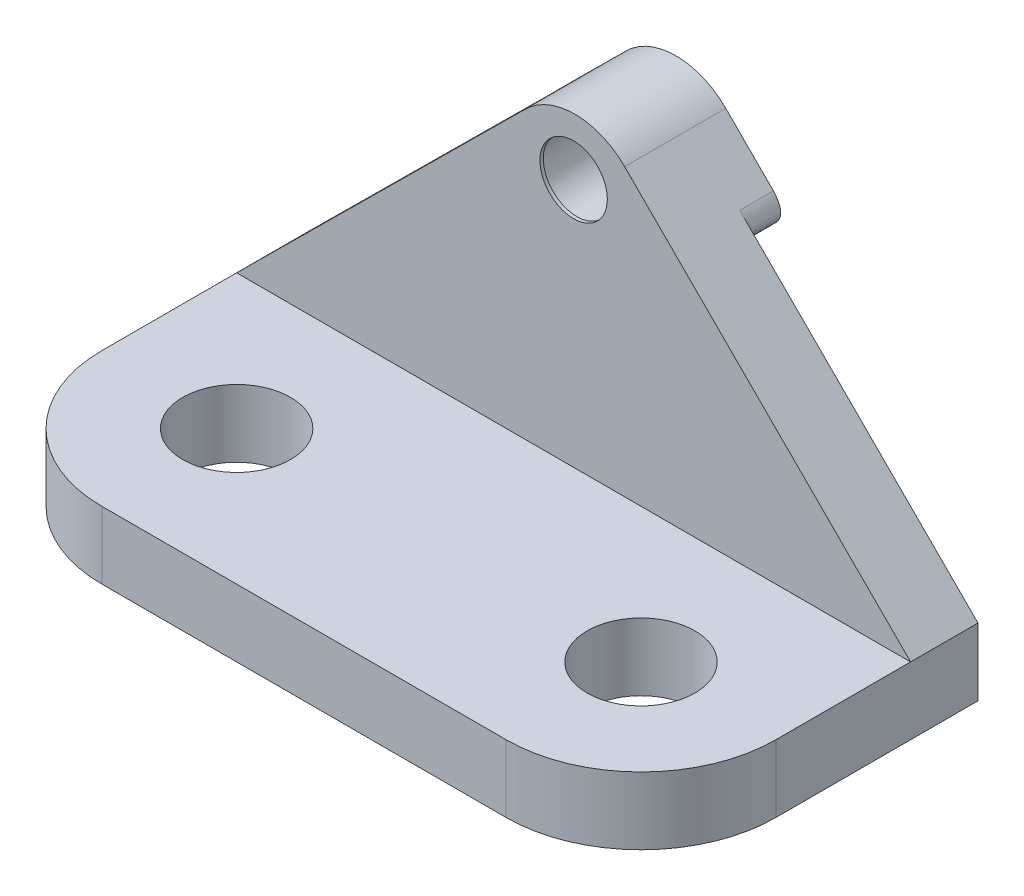
ISO-10303-21;
HEADER;
FILE_DESCRIPTION(('STEP AP214'),'2;1');
FILE_NAME('part.step','',(''),(''),'','','');
FILE_SCHEMA(('AUTOMOTIVE_DESIGN { 1 0 10303 214 1 1 1 1 }'));
ENDSEC;
DATA;
#1=APPLICATION_CONTEXT('core data for automotive mechanical design processes');
#2=APPLICATION_PROTOCOL_DEFINITION('international standard','automotive_design',2000,#1);
#3=PRODUCT_CONTEXT('',#1,'mechanical');
#4=PRODUCT('Part','Part','',(#3));
#5=PRODUCT_RELATED_PRODUCT_CATEGORY('part','',(#4));
#6=PRODUCT_DEFINITION_FORMATION('','',#4);
#7=PRODUCT_DEFINITION_CONTEXT('part definition',#1,'design');
#8=PRODUCT_DEFINITION('design','',#6,#7);
#9=PRODUCT_DEFINITION_SHAPE('','',#8);
#10=(LENGTH_UNIT() NAMED_UNIT(*) SI_UNIT(.MILLI.,.METRE.));
#11=(NAMED_UNIT(*) PLANE_ANGLE_UNIT() SI_UNIT($,.RADIAN.));
#12=(NAMED_UNIT(*) SI_UNIT($,.STERADIAN.) SOLID_ANGLE_UNIT());
#13=UNCERTAINTY_MEASURE_WITH_UNIT(LENGTH_MEASURE(1.E-05),#10,'distance_accuracy_value','');
#14=(GEOMETRIC_REPRESENTATION_CONTEXT(3) GLOBAL_UNCERTAINTY_ASSIGNED_CONTEXT((#13)) GLOBAL_UNIT_ASSIGNED_CONTEXT((#10,
#11,#12)) REPRESENTATION_CONTEXT('',''));
#15=CARTESIAN_POINT('',(0.,0.,0.));
#16=DIRECTION('',(0.,0.,1.));
#17=DIRECTION('',(1.,0.,0.));
#18=AXIS2_PLACEMENT_3D('',#15,#16,#17);
#19=CARTESIAN_POINT('',(0.,23.4788415531794,12.5));
#20=DIRECTION('',(0.,0.,-1.));
#21=DIRECTION('',(-1.,0.,0.));
#22=AXIS2_PLACEMENT_3D('',#19,#20,#21);
#23=CYLINDRICAL_SURFACE('',#22,2.5);
#24=CARTESIAN_POINT('',(0.,23.4788415531794,-7.5));
#25=DIRECTION('',(0.,0.,1.));
#26=DIRECTION('',(1.,0.,0.));
#27=AXIS2_PLACEMENT_3D('',#24,#25,#26);
#28=CIRCLE('',#27,2.5);
#29=CARTESIAN_POINT('',(2.5,23.4788415531794,-7.5));
#30=VERTEX_POINT('',#29);
#31=EDGE_CURVE('E164',#30,#30,#28,.T.);
#32=ORIENTED_EDGE('',*,*,#31,.T.);
#33=EDGE_LOOP('',(#32));
#34=FACE_BOUND('',#33,.T.);
#35=CARTESIAN_POINT('',(0.,23.4788415531794,-7.75));
#36=DIRECTION('',(0.,0.,-1.));
#37=DIRECTION('',(-1.,0.,0.));
#38=AXIS2_PLACEMENT_3D('',#35,#36,#37);
#39=CIRCLE('',#38,2.5);
#40=CARTESIAN_POINT('',(-2.5,23.4788415531794,-7.75));
#41=VERTEX_POINT('',#40);
#42=EDGE_CURVE('E38',#41,#41,#39,.F.);
#43=ORIENTED_EDGE('',*,*,#42,.F.);
#44=EDGE_LOOP('',(#43));
#45=FACE_BOUND('',#44,.T.);
#46=ADVANCED_FACE('F34',(#34,#45),#23,.F.);
#47=CARTESIAN_POINT('',(-25.,5.,-12.5));
#48=DIRECTION('',(0.,0.,1.));
#49=DIRECTION('',(1.,0.,0.));
#50=AXIS2_PLACEMENT_3D('',#47,#48,#49);
#51=PLANE('',#50);
#52=CARTESIAN_POINT('',(-6.90013036784785,20.2399334834772,-12.5));
#53=CARTESIAN_POINT('',(-8.70232576335587,21.2388118548097,-12.5));
#54=CARTESIAN_POINT('',(-7.24255586015702,22.5975332822631,-12.5));
#55=B_SPLINE_CURVE_WITH_KNOTS('',2,(#52,#53,#54),.UNSPECIFIED.,.F.,.F.,(3,3),(0.,1.),.UNSPECIFIED.);
#56=CARTESIAN_POINT('',(-6.90013036784785,20.2399334834771,-12.5));
#57=VERTEX_POINT('',#56);
#58=CARTESIAN_POINT('',(-7.40900852121652,22.43257957497,-12.5));
#59=VERTEX_POINT('',#58);
#60=EDGE_CURVE('E51',#57,#59,#55,.T.);
#61=ORIENTED_EDGE('',*,*,#60,.F.);
#62=CARTESIAN_POINT('',(-0.0436635000014337,32.9429249588641,-12.5));
#63=DIRECTION('',(0.,0.,-1.));
#64=DIRECTION('',(-1.,0.,0.));
#65=AXIS2_PLACEMENT_3D('',#62,#63,#64);
#66=CIRCLE('',#65,14.4352738226065);
#67=CARTESIAN_POINT('',(6.85532950865803,20.2629791466732,-12.5));
#68=VERTEX_POINT('',#67);
#69=EDGE_CURVE('E161',#68,#57,#66,.T.);
#70=ORIENTED_EDGE('',*,*,#69,.F.);
#71=CARTESIAN_POINT('',(7.32233047033633,22.6776695296637,-12.5));
#72=CARTESIAN_POINT('',(8.17845266769206,21.7030736056082,-12.5));
#73=CARTESIAN_POINT('',(8.02278568046596,20.898176811278,-12.5));
#74=CARTESIAN_POINT('',(6.85532950865803,20.2629791466732,-12.5));
#75=B_SPLINE_CURVE_WITH_KNOTS('',3,(#71,#72,#73,#74),.UNSPECIFIED.,.F.,.F.,(4,4),(0.,1.),.UNSPECIFIED.);
#76=CARTESIAN_POINT('',(7.32233047033635,22.6776695296637,-12.5));
#77=VERTEX_POINT('',#76);
#78=EDGE_CURVE('E57',#77,#68,#75,.T.);
#79=ORIENTED_EDGE('',*,*,#78,.F.);
#80=DIRECTION('',(0.707106781186547,-0.707106781186547,0.));
#81=VECTOR('',#80,1.);
#82=CARTESIAN_POINT('',(25.,5.,-12.5));
#83=LINE('',#82,#81);
#84=CARTESIAN_POINT('',(25.,5.,-12.5));
#85=VERTEX_POINT('',#84);
#86=EDGE_CURVE('E213',#77,#85,#83,.T.);
#87=ORIENTED_EDGE('',*,*,#86,.T.);
#88=DIRECTION('',(0.,-1.,0.));
#89=VECTOR('',#88,1.);
#90=CARTESIAN_POINT('',(25.,5.,-12.5));
#91=LINE('',#90,#89);
#92=CARTESIAN_POINT('',(25.,0.,-12.5));
#93=VERTEX_POINT('',#92);
#94=EDGE_CURVE('E324',#85,#93,#91,.T.);
#95=ORIENTED_EDGE('',*,*,#94,.T.);
#96=DIRECTION('',(-1.,0.,0.));
#97=VECTOR('',#96,1.);
#98=CARTESIAN_POINT('',(-25.,0.,-12.5));
#99=LINE('',#98,#97);
#100=CARTESIAN_POINT('',(-25.,0.,-12.5));
#101=VERTEX_POINT('',#100);
#102=EDGE_CURVE('E316',#93,#101,#99,.T.);
#103=ORIENTED_EDGE('',*,*,#102,.T.);
#104=DIRECTION('',(0.,-1.,0.));
#105=VECTOR('',#104,1.);
#106=CARTESIAN_POINT('',(-25.,5.,-12.5));
#107=LINE('',#106,#105);
#108=CARTESIAN_POINT('',(-25.,5.,-12.5));
#109=VERTEX_POINT('',#108);
#110=EDGE_CURVE('E314',#109,#101,#107,.T.);
#111=ORIENTED_EDGE('',*,*,#110,.F.);
#112=DIRECTION('',(0.710297765593719,0.703901331290523,0.));
#113=VECTOR('',#112,1.);
#114=CARTESIAN_POINT('',(-25.,5.,-12.5));
#115=LINE('',#114,#113);
#116=EDGE_CURVE('E205',#109,#59,#115,.T.);
#117=ORIENTED_EDGE('',*,*,#116,.T.);
#118=EDGE_LOOP('',(#61,#70,#79,#87,#95,#103,#111,#117));
#119=FACE_BOUND('',#118,.T.);
#120=ADVANCED_FACE('F372',(#119),#51,.F.);
#121=CARTESIAN_POINT('',(0.,5.,0.));
#122=DIRECTION('',(0.,-1.,0.));
#123=DIRECTION('',(0.,0.,-1.));
#124=AXIS2_PLACEMENT_3D('',#121,#122,#123);
#125=PLANE('',#124);
#126=CARTESIAN_POINT('',(-15.,5.,2.5));
#127=DIRECTION('',(0.,1.,0.));
#128=DIRECTION('',(0.,0.,1.));
#129=AXIS2_PLACEMENT_3D('',#126,#127,#128);
#130=CIRCLE('',#129,4.);
#131=CARTESIAN_POINT('',(-15.,5.,6.5));
#132=VERTEX_POINT('',#131);
#133=EDGE_CURVE('E298',#132,#132,#130,.T.);
#134=ORIENTED_EDGE('',*,*,#133,.F.);
#135=EDGE_LOOP('',(#134));
#136=FACE_BOUND('',#135,.T.);
#137=DIRECTION('',(0.,0.,-1.));
#138=VECTOR('',#137,1.);
#139=CARTESIAN_POINT('',(25.,5.,12.5));
#140=LINE('',#139,#138);
#141=CARTESIAN_POINT('',(25.,5.,2.5));
#142=VERTEX_POINT('',#141);
#143=CARTESIAN_POINT('',(25.,5.,-7.5));
#144=VERTEX_POINT('',#143);
#145=EDGE_CURVE('E304',#142,#144,#140,.T.);
#146=ORIENTED_EDGE('',*,*,#145,.T.);
#147=DIRECTION('',(-1.,0.,0.));
#148=VECTOR('',#147,1.);
#149=CARTESIAN_POINT('',(0.,5.,-7.5));
#150=LINE('',#149,#148);
#151=CARTESIAN_POINT('',(-25.,5.,-7.5));
#152=VERTEX_POINT('',#151);
#153=EDGE_CURVE('E288',#144,#152,#150,.T.);
#154=ORIENTED_EDGE('',*,*,#153,.T.);
#155=DIRECTION('',(0.,0.,1.));
#156=VECTOR('',#155,1.);
#157=CARTESIAN_POINT('',(-25.,5.,12.5));
#158=LINE('',#157,#156);
#159=CARTESIAN_POINT('',(-25.,5.,2.5));
#160=VERTEX_POINT('',#159);
#161=EDGE_CURVE('E307',#152,#160,#158,.T.);
#162=ORIENTED_EDGE('',*,*,#161,.T.);
#163=CARTESIAN_POINT('',(-15.,5.,2.5));
#164=DIRECTION('',(0.,-1.,0.));
#165=DIRECTION('',(0.,0.,-1.));
#166=AXIS2_PLACEMENT_3D('',#163,#164,#165);
#167=CIRCLE('',#166,10.);
#168=CARTESIAN_POINT('',(-15.,5.,12.5));
#169=VERTEX_POINT('',#168);
#170=EDGE_CURVE('E340',#160,#169,#167,.F.);
#171=ORIENTED_EDGE('',*,*,#170,.T.);
#172=DIRECTION('',(1.,0.,0.));
#173=VECTOR('',#172,1.);
#174=CARTESIAN_POINT('',(-25.,5.,12.5));
#175=LINE('',#174,#173);
#176=CARTESIAN_POINT('',(15.,5.,12.5));
#177=VERTEX_POINT('',#176);
#178=EDGE_CURVE('E311',#169,#177,#175,.T.);
#179=ORIENTED_EDGE('',*,*,#178,.T.);
#180=CARTESIAN_POINT('',(15.,5.,2.5));
#181=DIRECTION('',(0.,-1.,0.));
#182=DIRECTION('',(0.,0.,-1.));
#183=AXIS2_PLACEMENT_3D('',#180,#181,#182);
#184=CIRCLE('',#183,10.);
#185=EDGE_CURVE('E43',#177,#142,#184,.F.);
#186=ORIENTED_EDGE('',*,*,#185,.T.);
#187=EDGE_LOOP('',(#146,#154,#162,#171,#179,#186));
#188=FACE_BOUND('',#187,.T.);
#189=CARTESIAN_POINT('',(15.,5.,2.5));
#190=DIRECTION('',(0.,1.,0.));
#191=DIRECTION('',(0.,0.,1.));
#192=AXIS2_PLACEMENT_3D('',#189,#190,#191);
#193=CIRCLE('',#192,4.);
#194=CARTESIAN_POINT('',(15.,5.,6.5));
#195=VERTEX_POINT('',#194);
#196=EDGE_CURVE('E292',#195,#195,#193,.T.);
#197=ORIENTED_EDGE('',*,*,#196,.F.);
#198=EDGE_LOOP('',(#197));
#199=FACE_BOUND('',#198,.T.);
#200=ADVANCED_FACE('F344',(#136,#188,#199),#125,.F.);
#201=CARTESIAN_POINT('',(0.,0.,0.));
#202=DIRECTION('',(0.,-1.,0.));
#203=DIRECTION('',(0.,0.,-1.));
#204=AXIS2_PLACEMENT_3D('',#201,#202,#203);
#205=PLANE('',#204);
#206=CARTESIAN_POINT('',(-15.,0.,2.5));
#207=DIRECTION('',(0.,-1.,0.));
#208=DIRECTION('',(0.,0.,-1.));
#209=AXIS2_PLACEMENT_3D('',#206,#207,#208);
#210=CIRCLE('',#209,10.);
#211=CARTESIAN_POINT('',(-15.,0.,12.5));
#212=VERTEX_POINT('',#211);
#213=CARTESIAN_POINT('',(-25.,0.,2.5));
#214=VERTEX_POINT('',#213);
#215=EDGE_CURVE('E330',#212,#214,#210,.T.);
#216=ORIENTED_EDGE('',*,*,#215,.T.);
#217=DIRECTION('',(0.,0.,1.));
#218=VECTOR('',#217,1.);
#219=CARTESIAN_POINT('',(-25.,0.,12.5));
#220=LINE('',#219,#218);
#221=EDGE_CURVE('E318',#101,#214,#220,.T.);
#222=ORIENTED_EDGE('',*,*,#221,.F.);
#223=ORIENTED_EDGE('',*,*,#102,.F.);
#224=DIRECTION('',(0.,0.,-1.));
#225=VECTOR('',#224,1.);
#226=CARTESIAN_POINT('',(25.,0.,12.5));
#227=LINE('',#226,#225);
#228=CARTESIAN_POINT('',(25.,0.,2.5));
#229=VERTEX_POINT('',#228);
#230=EDGE_CURVE('E301',#229,#93,#227,.T.);
#231=ORIENTED_EDGE('',*,*,#230,.F.);
#232=CARTESIAN_POINT('',(15.,0.,2.5));
#233=DIRECTION('',(0.,-1.,0.));
#234=DIRECTION('',(0.,0.,-1.));
#235=AXIS2_PLACEMENT_3D('',#232,#233,#234);
#236=CIRCLE('',#235,10.);
#237=CARTESIAN_POINT('',(15.,0.,12.5));
#238=VERTEX_POINT('',#237);
#239=EDGE_CURVE('E333',#229,#238,#236,.T.);
#240=ORIENTED_EDGE('',*,*,#239,.T.);
#241=DIRECTION('',(1.,0.,0.));
#242=VECTOR('',#241,1.);
#243=CARTESIAN_POINT('',(-25.,0.,12.5));
#244=LINE('',#243,#242);
#245=EDGE_CURVE('E308',#212,#238,#244,.T.);
#246=ORIENTED_EDGE('',*,*,#245,.F.);
#247=EDGE_LOOP('',(#216,#222,#223,#231,#240,#246));
#248=FACE_BOUND('',#247,.T.);
#249=CARTESIAN_POINT('',(-15.,0.,2.5));
#250=DIRECTION('',(0.,1.,0.));
#251=DIRECTION('',(0.,0.,1.));
#252=AXIS2_PLACEMENT_3D('',#249,#250,#251);
#253=CIRCLE('',#252,4.);
#254=CARTESIAN_POINT('',(-15.,0.,6.5));
#255=VERTEX_POINT('',#254);
#256=EDGE_CURVE('E295',#255,#255,#253,.T.);
#257=ORIENTED_EDGE('',*,*,#256,.T.);
#258=EDGE_LOOP('',(#257));
#259=FACE_BOUND('',#258,.T.);
#260=CARTESIAN_POINT('',(15.,0.,2.5));
#261=DIRECTION('',(0.,1.,0.));
#262=DIRECTION('',(0.,0.,1.));
#263=AXIS2_PLACEMENT_3D('',#260,#261,#262);
#264=CIRCLE('',#263,4.);
#265=CARTESIAN_POINT('',(15.,0.,6.5));
#266=VERTEX_POINT('',#265);
#267=EDGE_CURVE('E291',#266,#266,#264,.T.);
#268=ORIENTED_EDGE('',*,*,#267,.T.);
#269=EDGE_LOOP('',(#268));
#270=FACE_BOUND('',#269,.T.);
#271=ADVANCED_FACE('F359',(#248,#259,#270),#205,.T.);
#272=CARTESIAN_POINT('',(25.,5.,12.5));
#273=DIRECTION('',(-1.,0.,0.));
#274=DIRECTION('',(0.,0.,1.));
#275=AXIS2_PLACEMENT_3D('',#272,#273,#274);
#276=PLANE('',#275);
#277=ORIENTED_EDGE('',*,*,#230,.T.);
#278=ORIENTED_EDGE('',*,*,#94,.F.);
#279=DIRECTION('',(0.,0.,-1.));
#280=VECTOR('',#279,1.);
#281=CARTESIAN_POINT('',(25.,5.,-7.5));
#282=LINE('',#281,#280);
#283=EDGE_CURVE('E144',#144,#85,#282,.T.);
#284=ORIENTED_EDGE('',*,*,#283,.F.);
#285=ORIENTED_EDGE('',*,*,#145,.F.);
#286=DIRECTION('',(0.,-1.,0.));
#287=VECTOR('',#286,1.);
#288=CARTESIAN_POINT('',(25.,5.,2.5));
#289=LINE('',#288,#287);
#290=EDGE_CURVE('E327',#142,#229,#289,.T.);
#291=ORIENTED_EDGE('',*,*,#290,.T.);
#292=EDGE_LOOP('',(#277,#278,#284,#285,#291));
#293=FACE_BOUND('',#292,.T.);
#294=ADVANCED_FACE('F352',(#293),#276,.F.);
#295=CARTESIAN_POINT('',(-25.,5.,12.5));
#296=DIRECTION('',(1.,0.,0.));
#297=DIRECTION('',(0.,0.,-1.));
#298=AXIS2_PLACEMENT_3D('',#295,#296,#297);
#299=PLANE('',#298);
#300=ORIENTED_EDGE('',*,*,#161,.F.);
#301=EDGE_CURVE('E309',#109,#152,#158,.T.);
#302=ORIENTED_EDGE('',*,*,#301,.F.);
#303=ORIENTED_EDGE('',*,*,#110,.T.);
#304=ORIENTED_EDGE('',*,*,#221,.T.);
#305=DIRECTION('',(0.,-1.,0.));
#306=VECTOR('',#305,1.);
#307=CARTESIAN_POINT('',(-25.,5.,2.5));
#308=LINE('',#307,#306);
#309=EDGE_CURVE('E11',#214,#160,#308,.F.);
#310=ORIENTED_EDGE('',*,*,#309,.T.);
#311=EDGE_LOOP('',(#300,#302,#303,#304,#310));
#312=FACE_BOUND('',#311,.T.);
#313=ADVANCED_FACE('F370',(#312),#299,.F.);
#314=CARTESIAN_POINT('',(-25.,5.,12.5));
#315=DIRECTION('',(0.,0.,-1.));
#316=DIRECTION('',(-1.,0.,0.));
#317=AXIS2_PLACEMENT_3D('',#314,#315,#316);
#318=PLANE('',#317);
#319=ORIENTED_EDGE('',*,*,#245,.T.);
#320=DIRECTION('',(0.,-1.,0.));
#321=VECTOR('',#320,1.);
#322=CARTESIAN_POINT('',(15.,5.,12.5));
#323=LINE('',#322,#321);
#324=EDGE_CURVE('E338',#238,#177,#323,.F.);
#325=ORIENTED_EDGE('',*,*,#324,.T.);
#326=ORIENTED_EDGE('',*,*,#178,.F.);
#327=DIRECTION('',(0.,-1.,0.));
#328=VECTOR('',#327,1.);
#329=CARTESIAN_POINT('',(-15.,5.,12.5));
#330=LINE('',#329,#328);
#331=EDGE_CURVE('E335',#169,#212,#330,.T.);
#332=ORIENTED_EDGE('',*,*,#331,.T.);
#333=EDGE_LOOP('',(#319,#325,#326,#332));
#334=FACE_BOUND('',#333,.T.);
#335=ADVANCED_FACE('F363',(#334),#318,.F.);
#336=CARTESIAN_POINT('',(-15.,5.,2.5));
#337=DIRECTION('',(0.,-1.,0.));
#338=DIRECTION('',(0.,0.,-1.));
#339=AXIS2_PLACEMENT_3D('',#336,#337,#338);
#340=CYLINDRICAL_SURFACE('',#339,4.);
#341=ORIENTED_EDGE('',*,*,#133,.T.);
#342=EDGE_LOOP('',(#341));
#343=FACE_BOUND('',#342,.T.);
#344=ORIENTED_EDGE('',*,*,#256,.F.);
#345=EDGE_LOOP('',(#344));
#346=FACE_BOUND('',#345,.T.);
#347=ADVANCED_FACE('F392',(#343,#346),#340,.F.);
#348=CARTESIAN_POINT('',(15.,5.,2.5));
#349=DIRECTION('',(0.,-1.,0.));
#350=DIRECTION('',(0.,0.,-1.));
#351=AXIS2_PLACEMENT_3D('',#348,#349,#350);
#352=CYLINDRICAL_SURFACE('',#351,4.);
#353=ORIENTED_EDGE('',*,*,#196,.T.);
#354=EDGE_LOOP('',(#353));
#355=FACE_BOUND('',#354,.T.);
#356=ORIENTED_EDGE('',*,*,#267,.F.);
#357=EDGE_LOOP('',(#356));
#358=FACE_BOUND('',#357,.T.);
#359=ADVANCED_FACE('F197',(#355,#358),#352,.F.);
#360=CARTESIAN_POINT('',(15.,5.,2.5));
#361=DIRECTION('',(0.,-1.,0.));
#362=DIRECTION('',(0.,0.,-1.));
#363=AXIS2_PLACEMENT_3D('',#360,#361,#362);
#364=CYLINDRICAL_SURFACE('',#363,10.);
#365=ORIENTED_EDGE('',*,*,#185,.F.);
#366=ORIENTED_EDGE('',*,*,#324,.F.);
#367=ORIENTED_EDGE('',*,*,#239,.F.);
#368=ORIENTED_EDGE('',*,*,#290,.F.);
#369=EDGE_LOOP('',(#365,#366,#367,#368));
#370=FACE_BOUND('',#369,.T.);
#371=ADVANCED_FACE('F356',(#370),#364,.T.);
#372=CARTESIAN_POINT('',(-15.,5.,2.5));
#373=DIRECTION('',(0.,-1.,0.));
#374=DIRECTION('',(0.,0.,-1.));
#375=AXIS2_PLACEMENT_3D('',#372,#373,#374);
#376=CYLINDRICAL_SURFACE('',#375,10.);
#377=ORIENTED_EDGE('',*,*,#170,.F.);
#378=ORIENTED_EDGE('',*,*,#309,.F.);
#379=ORIENTED_EDGE('',*,*,#215,.F.);
#380=ORIENTED_EDGE('',*,*,#331,.F.);
#381=EDGE_LOOP('',(#377,#378,#379,#380));
#382=FACE_BOUND('',#381,.T.);
#383=ADVANCED_FACE('F36',(#382),#376,.T.);
#384=CARTESIAN_POINT('',(0.094725576463347,22.5211324476562,-7.5));
#385=DIRECTION('',(0.,0.,1.));
#386=DIRECTION('',(1.,0.,0.));
#387=AXIS2_PLACEMENT_3D('',#384,#385,#386);
#388=PLANE('',#387);
#389=ORIENTED_EDGE('',*,*,#31,.F.);
#390=EDGE_LOOP('',(#389));
#391=FACE_BOUND('',#390,.T.);
#392=ORIENTED_EDGE('',*,*,#153,.F.);
#393=DIRECTION('',(0.707106781186547,-0.707106781186547,0.));
#394=VECTOR('',#393,1.);
#395=CARTESIAN_POINT('',(25.,5.,-7.5));
#396=LINE('',#395,#394);
#397=CARTESIAN_POINT('',(3.7867965644036,26.2132034355964,-7.5));
#398=VERTEX_POINT('',#397);
#399=EDGE_CURVE('E219',#398,#144,#396,.T.);
#400=ORIENTED_EDGE('',*,*,#399,.F.);
#401=CARTESIAN_POINT('',(0.094725576463347,22.5211324476562,-7.5));
#402=DIRECTION('',(0.,0.,-1.));
#403=DIRECTION('',(1.,0.,0.));
#404=AXIS2_PLACEMENT_3D('',#401,#402,#403);
#405=CIRCLE('',#404,5.22137686438934);
#406=CARTESIAN_POINT('',(-3.69106703218842,26.1170399387157,-7.5));
#407=VERTEX_POINT('',#406);
#408=EDGE_CURVE('E140',#407,#398,#405,.T.);
#409=ORIENTED_EDGE('',*,*,#408,.F.);
#410=DIRECTION('',(0.710297765593719,0.703901331290523,0.));
#411=VECTOR('',#410,1.);
#412=CARTESIAN_POINT('',(-25.,5.,-7.5));
#413=LINE('',#412,#411);
#414=EDGE_CURVE('E224',#152,#407,#413,.T.);
#415=ORIENTED_EDGE('',*,*,#414,.F.);
#416=EDGE_LOOP('',(#392,#400,#409,#415));
#417=FACE_BOUND('',#416,.T.);
#418=ADVANCED_FACE('F185',(#391,#417),#388,.T.);
#419=CARTESIAN_POINT('',(25.,5.,-7.5));
#420=DIRECTION('',(0.707106781186548,0.707106781186548,0.));
#421=DIRECTION('',(-0.707106781186548,0.707106781186548,0.));
#422=AXIS2_PLACEMENT_3D('',#419,#420,#421);
#423=PLANE('',#422);
#424=ORIENTED_EDGE('',*,*,#86,.F.);
#425=DIRECTION('',(0.,0.,1.));
#426=VECTOR('',#425,1.);
#427=CARTESIAN_POINT('',(7.32233047033634,22.6776695296637,-15.));
#428=LINE('',#427,#426);
#429=CARTESIAN_POINT('',(7.32233047033634,22.6776695296637,-15.));
#430=VERTEX_POINT('',#429);
#431=EDGE_CURVE('E151',#430,#77,#428,.T.);
#432=ORIENTED_EDGE('',*,*,#431,.F.);
#433=DIRECTION('',(0.707106781186548,-0.707106781186547,0.));
#434=VECTOR('',#433,1.);
#435=CARTESIAN_POINT('',(3.7867965644036,26.2132034355964,-15.));
#436=LINE('',#435,#434);
#437=CARTESIAN_POINT('',(3.7867965644036,26.2132034355964,-15.));
#438=VERTEX_POINT('',#437);
#439=EDGE_CURVE('E148',#438,#430,#436,.T.);
#440=ORIENTED_EDGE('',*,*,#439,.F.);
#441=DIRECTION('',(0.,0.,-1.));
#442=VECTOR('',#441,1.);
#443=CARTESIAN_POINT('',(3.7867965644036,26.2132034355964,-7.5));
#444=LINE('',#443,#442);
#445=EDGE_CURVE('E134',#398,#438,#444,.T.);
#446=ORIENTED_EDGE('',*,*,#445,.F.);
#447=ORIENTED_EDGE('',*,*,#399,.T.);
#448=ORIENTED_EDGE('',*,*,#283,.T.);
#449=EDGE_LOOP('',(#424,#432,#440,#446,#447,#448));
#450=FACE_BOUND('',#449,.T.);
#451=ADVANCED_FACE('F149',(#450),#423,.T.);
#452=CARTESIAN_POINT('',(0.094725576463347,22.5211324476562,-7.5));
#453=DIRECTION('',(0.,0.,-1.));
#454=DIRECTION('',(-1.,0.,0.));
#455=AXIS2_PLACEMENT_3D('',#452,#453,#454);
#456=CYLINDRICAL_SURFACE('',#455,5.22137686438934);
#457=ORIENTED_EDGE('',*,*,#445,.T.);
#458=CARTESIAN_POINT('',(0.0947255764633479,22.5211324476562,-15.));
#459=DIRECTION('',(0.,0.,-1.));
#460=DIRECTION('',(1.,0.,0.));
#461=AXIS2_PLACEMENT_3D('',#458,#459,#460);
#462=CIRCLE('',#461,5.22137686438934);
#463=CARTESIAN_POINT('',(-3.69106703218842,26.1170399387157,-15.));
#464=VERTEX_POINT('',#463);
#465=EDGE_CURVE('E138',#464,#438,#462,.T.);
#466=ORIENTED_EDGE('',*,*,#465,.F.);
#467=DIRECTION('',(0.,0.,-1.));
#468=VECTOR('',#467,1.);
#469=CARTESIAN_POINT('',(-3.69106703218842,26.1170399387157,-7.5));
#470=LINE('',#469,#468);
#471=EDGE_CURVE('E145',#407,#464,#470,.T.);
#472=ORIENTED_EDGE('',*,*,#471,.F.);
#473=ORIENTED_EDGE('',*,*,#408,.T.);
#474=EDGE_LOOP('',(#457,#466,#472,#473));
#475=FACE_BOUND('',#474,.T.);
#476=ADVANCED_FACE('F136',(#475),#456,.T.);
#477=CARTESIAN_POINT('',(-25.,5.,-7.5));
#478=DIRECTION('',(-0.703901331290523,0.710297765593719,0.));
#479=DIRECTION('',(-0.710297765593719,-0.703901331290523,0.));
#480=AXIS2_PLACEMENT_3D('',#477,#478,#479);
#481=PLANE('',#480);
#482=ORIENTED_EDGE('',*,*,#116,.F.);
#483=ORIENTED_EDGE('',*,*,#301,.T.);
#484=ORIENTED_EDGE('',*,*,#414,.T.);
#485=ORIENTED_EDGE('',*,*,#471,.T.);
#486=DIRECTION('',(0.710297765593719,0.703901331290523,0.));
#487=VECTOR('',#486,1.);
#488=CARTESIAN_POINT('',(-3.69106703218842,26.1170399387157,-15.));
#489=LINE('',#488,#487);
#490=CARTESIAN_POINT('',(-7.24255586015702,22.5975332822631,-15.));
#491=VERTEX_POINT('',#490);
#492=EDGE_CURVE('E159',#491,#464,#489,.T.);
#493=ORIENTED_EDGE('',*,*,#492,.F.);
#494=DIRECTION('',(0.,0.,1.));
#495=VECTOR('',#494,1.);
#496=CARTESIAN_POINT('',(-7.24255586015702,22.5975332822631,-15.));
#497=LINE('',#496,#495);
#498=CARTESIAN_POINT('',(-7.24255586015701,22.5975332822631,-12.5));
#499=VERTEX_POINT('',#498);
#500=EDGE_CURVE('E236',#491,#499,#497,.T.);
#501=ORIENTED_EDGE('',*,*,#500,.T.);
#502=CARTESIAN_POINT('',(-7.40900852121639,22.43257957497,-12.5));
#503=CARTESIAN_POINT('',(-7.33189048845195,22.5143825929579,-12.5));
#504=CARTESIAN_POINT('',(-7.24255586015702,22.5975332822631,-12.5));
#505=B_SPLINE_CURVE_WITH_KNOTS('',2,(#502,#503,#504),.UNSPECIFIED.,.F.,.F.,(3,3),
(0.938802253629719,1.),.UNSPECIFIED.);
#506=EDGE_CURVE('E214',#59,#499,#505,.T.);
#507=ORIENTED_EDGE('',*,*,#506,.F.);
#508=EDGE_LOOP('',(#482,#483,#484,#485,#493,#501,#507));
#509=FACE_BOUND('',#508,.T.);
#510=ADVANCED_FACE('F182',(#509),#481,.T.);
#511=CARTESIAN_POINT('',(7.32233047033633,22.6776695296637,-15.));
#512=CARTESIAN_POINT('',(8.17845266769206,21.7030736056082,-15.));
#513=CARTESIAN_POINT('',(8.02278568046596,20.898176811278,-15.));
#514=CARTESIAN_POINT('',(6.85532950865803,20.2629791466732,-15.));
#515=B_SPLINE_CURVE_WITH_KNOTS('',3,(#511,#512,#513,#514),.UNSPECIFIED.,.F.,.F.,(4,4),(0.,1.),.UNSPECIFIED.);
#516=DIRECTION('',(0.,0.,1.));
#517=VECTOR('',#516,1.);
#518=SURFACE_OF_LINEAR_EXTRUSION('',#515,#517);
#519=ORIENTED_EDGE('',*,*,#78,.T.);
#520=DIRECTION('',(0.,0.,1.));
#521=VECTOR('',#520,1.);
#522=CARTESIAN_POINT('',(6.85532950865803,20.2629791466732,-15.));
#523=LINE('',#522,#521);
#524=CARTESIAN_POINT('',(6.85532950865803,20.2629791466732,-15.));
#525=VERTEX_POINT('',#524);
#526=EDGE_CURVE('E234',#525,#68,#523,.T.);
#527=ORIENTED_EDGE('',*,*,#526,.F.);
#528=EDGE_CURVE('E154',#430,#525,#515,.T.);
#529=ORIENTED_EDGE('',*,*,#528,.F.);
#530=ORIENTED_EDGE('',*,*,#431,.T.);
#531=EDGE_LOOP('',(#519,#527,#529,#530));
#532=FACE_BOUND('',#531,.T.);
#533=ADVANCED_FACE('F177',(#532),#518,.F.);
#534=CARTESIAN_POINT('',(-0.0436635000014337,32.9429249588641,-15.));
#535=DIRECTION('',(0.,0.,1.));
#536=DIRECTION('',(1.,0.,0.));
#537=AXIS2_PLACEMENT_3D('',#534,#535,#536);
#538=CYLINDRICAL_SURFACE('',#537,14.4352738226065);
#539=ORIENTED_EDGE('',*,*,#69,.T.);
#540=DIRECTION('',(0.,0.,1.));
#541=VECTOR('',#540,1.);
#542=CARTESIAN_POINT('',(-6.90013036784785,20.2399334834771,-15.));
#543=LINE('',#542,#541);
#544=CARTESIAN_POINT('',(-6.90013036784785,20.2399334834771,-15.));
#545=VERTEX_POINT('',#544);
#546=EDGE_CURVE('E239',#545,#57,#543,.T.);
#547=ORIENTED_EDGE('',*,*,#546,.F.);
#548=CARTESIAN_POINT('',(-0.0436635000014337,32.9429249588641,-15.));
#549=DIRECTION('',(0.,0.,-1.));
#550=DIRECTION('',(-1.,0.,0.));
#551=AXIS2_PLACEMENT_3D('',#548,#549,#550);
#552=CIRCLE('',#551,14.4352738226065);
#553=EDGE_CURVE('E171',#525,#545,#552,.T.);
#554=ORIENTED_EDGE('',*,*,#553,.F.);
#555=ORIENTED_EDGE('',*,*,#526,.T.);
#556=EDGE_LOOP('',(#539,#547,#554,#555));
#557=FACE_BOUND('',#556,.T.);
#558=ADVANCED_FACE('F181',(#557),#538,.T.);
#559=CARTESIAN_POINT('',(-6.90013036784785,20.2399334834772,-15.));
#560=CARTESIAN_POINT('',(-8.70232576335587,21.2388118548097,-15.));
#561=CARTESIAN_POINT('',(-7.24255586015702,22.5975332822631,-15.));
#562=B_SPLINE_CURVE_WITH_KNOTS('',2,(#559,#560,#561),.UNSPECIFIED.,.F.,.F.,(3,3),(0.,1.),.UNSPECIFIED.);
#563=DIRECTION('',(0.,0.,1.));
#564=VECTOR('',#563,1.);
#565=SURFACE_OF_LINEAR_EXTRUSION('',#562,#564);
#566=ORIENTED_EDGE('',*,*,#60,.T.);
#567=ORIENTED_EDGE('',*,*,#506,.T.);
#568=ORIENTED_EDGE('',*,*,#500,.F.);
#569=EDGE_CURVE('E258',#545,#491,#562,.T.);
#570=ORIENTED_EDGE('',*,*,#569,.F.);
#571=ORIENTED_EDGE('',*,*,#546,.T.);
#572=EDGE_LOOP('',(#566,#567,#568,#570,#571));
#573=FACE_BOUND('',#572,.T.);
#574=ADVANCED_FACE('F248',(#573),#565,.F.);
#575=CARTESIAN_POINT('',(0.0947255764633479,22.5211324476562,-15.));
#576=DIRECTION('',(0.,0.,1.));
#577=DIRECTION('',(1.,0.,0.));
#578=AXIS2_PLACEMENT_3D('',#575,#576,#577);
#579=PLANE('',#578);
#580=CARTESIAN_POINT('',(0.,23.4788415531794,-15.));
#581=DIRECTION('',(0.,0.,-1.));
#582=DIRECTION('',(-1.,0.,0.));
#583=AXIS2_PLACEMENT_3D('',#580,#581,#582);
#584=CIRCLE('',#583,2.75);
#585=CARTESIAN_POINT('',(-2.75,23.4788415531794,-15.));
#586=VERTEX_POINT('',#585);
#587=EDGE_CURVE('E555',#586,#586,#584,.T.);
#588=ORIENTED_EDGE('',*,*,#587,.F.);
#589=EDGE_LOOP('',(#588));
#590=FACE_BOUND('',#589,.T.);
#591=ORIENTED_EDGE('',*,*,#465,.T.);
#592=ORIENTED_EDGE('',*,*,#439,.T.);
#593=ORIENTED_EDGE('',*,*,#528,.T.);
#594=ORIENTED_EDGE('',*,*,#553,.T.);
#595=ORIENTED_EDGE('',*,*,#569,.T.);
#596=ORIENTED_EDGE('',*,*,#492,.T.);
#597=EDGE_LOOP('',(#591,#592,#593,#594,#595,#596));
#598=FACE_BOUND('',#597,.T.);
#599=ADVANCED_FACE('F157',(#590,#598),#579,.F.);
#600=CARTESIAN_POINT('',(0.,23.4788415531794,-7.75));
#601=DIRECTION('',(0.,0.,-1.));
#602=DIRECTION('',(-1.,0.,0.));
#603=AXIS2_PLACEMENT_3D('',#600,#601,#602);
#604=PLANE('',#603);
#605=CARTESIAN_POINT('',(0.,23.4788415531794,-7.75));
#606=DIRECTION('',(0.,0.,-1.));
#607=DIRECTION('',(-1.,0.,0.));
#608=AXIS2_PLACEMENT_3D('',#605,#606,#607);
#609=CIRCLE('',#608,2.75);
#610=CARTESIAN_POINT('',(-2.75,23.4788415531794,-7.75));
#611=VERTEX_POINT('',#610);
#612=EDGE_CURVE('E552',#611,#611,#609,.T.);
#613=ORIENTED_EDGE('',*,*,#612,.T.);
#614=EDGE_LOOP('',(#613));
#615=FACE_BOUND('',#614,.T.);
#616=ORIENTED_EDGE('',*,*,#42,.T.);
#617=EDGE_LOOP('',(#616));
#618=FACE_BOUND('',#617,.T.);
#619=ADVANCED_FACE('F490',(#615,#618),#604,.T.);
#620=CARTESIAN_POINT('',(0.,23.4788415531794,-7.75));
#621=DIRECTION('',(0.,0.,-1.));
#622=DIRECTION('',(-1.,0.,0.));
#623=AXIS2_PLACEMENT_3D('',#620,#621,#622);
#624=CYLINDRICAL_SURFACE('',#623,2.75);
#625=CARTESIAN_POINT('',(-2.75,23.4788415531794,-7.75));
#626=CARTESIAN_POINT('',(-2.75,23.4788415531794,-7.82552083333333));
#627=CARTESIAN_POINT('',(-2.75,23.4788415531794,-7.90104166666667));
#628=CARTESIAN_POINT('',(-2.75,23.4788415531794,-8.05208333333333));
#629=CARTESIAN_POINT('',(-2.75,23.4788415531794,-8.12760416666667));
#630=CARTESIAN_POINT('',(-2.75,23.4788415531794,-8.27864583333333));
#631=CARTESIAN_POINT('',(-2.75,23.4788415531794,-8.35416666666667));
#632=CARTESIAN_POINT('',(-2.75,23.4788415531794,-8.50520833333333));
#633=CARTESIAN_POINT('',(-2.75,23.4788415531794,-8.58072916666667));
#634=CARTESIAN_POINT('',(-2.75,23.4788415531794,-8.73177083333333));
#635=CARTESIAN_POINT('',(-2.75,23.4788415531794,-8.80729166666667));
#636=CARTESIAN_POINT('',(-2.75,23.4788415531794,-8.95833333333333));
#637=CARTESIAN_POINT('',(-2.75,23.4788415531794,-9.03385416666667));
#638=CARTESIAN_POINT('',(-2.75,23.4788415531794,-9.18489583333334));
#639=CARTESIAN_POINT('',(-2.75,23.4788415531794,-9.26041666666667));
#640=CARTESIAN_POINT('',(-2.75,23.4788415531794,-9.41145833333333));
#641=CARTESIAN_POINT('',(-2.75,23.4788415531794,-9.48697916666667));
#642=CARTESIAN_POINT('',(-2.75,23.4788415531794,-9.63802083333333));
#643=CARTESIAN_POINT('',(-2.75,23.4788415531794,-9.71354166666667));
#644=CARTESIAN_POINT('',(-2.75,23.4788415531794,-9.86458333333333));
#645=CARTESIAN_POINT('',(-2.75,23.4788415531794,-9.94010416666667));
#646=CARTESIAN_POINT('',(-2.75,23.4788415531794,-10.0911458333333));
#647=CARTESIAN_POINT('',(-2.75,23.4788415531794,-10.1666666666667));
#648=CARTESIAN_POINT('',(-2.75,23.4788415531794,-10.3177083333333));
#649=CARTESIAN_POINT('',(-2.75,23.4788415531794,-10.3932291666667));
#650=CARTESIAN_POINT('',(-2.75,23.4788415531794,-10.5442708333333));
#651=CARTESIAN_POINT('',(-2.75,23.4788415531794,-10.6197916666667));
#652=CARTESIAN_POINT('',(-2.75,23.4788415531794,-10.7708333333333));
#653=CARTESIAN_POINT('',(-2.75,23.4788415531794,-10.8463541666667));
#654=CARTESIAN_POINT('',(-2.75,23.4788415531794,-10.9973958333333));
#655=CARTESIAN_POINT('',(-2.75,23.4788415531794,-11.0729166666667));
#656=CARTESIAN_POINT('',(-2.75,23.4788415531794,-11.2239583333333));
#657=CARTESIAN_POINT('',(-2.75,23.4788415531794,-11.2994791666667));
#658=CARTESIAN_POINT('',(-2.75,23.4788415531794,-11.4505208333333));
#659=CARTESIAN_POINT('',(-2.75,23.4788415531794,-11.5260416666667));
#660=CARTESIAN_POINT('',(-2.75,23.4788415531794,-11.6770833333333));
#661=CARTESIAN_POINT('',(-2.75,23.4788415531794,-11.7526041666667));
#662=CARTESIAN_POINT('',(-2.75,23.4788415531794,-11.9036458333333));
#663=CARTESIAN_POINT('',(-2.75,23.4788415531794,-11.9791666666667));
#664=CARTESIAN_POINT('',(-2.75,23.4788415531794,-12.1302083333333));
#665=CARTESIAN_POINT('',(-2.75,23.4788415531794,-12.2057291666667));
#666=CARTESIAN_POINT('',(-2.75,23.4788415531794,-12.3567708333333));
#667=CARTESIAN_POINT('',(-2.75,23.4788415531794,-12.4322916666667));
#668=CARTESIAN_POINT('',(-2.75,23.4788415531794,-12.5833333333333));
#669=CARTESIAN_POINT('',(-2.75,23.4788415531794,-12.6588541666667));
#670=CARTESIAN_POINT('',(-2.75,23.4788415531794,-12.8098958333333));
#671=CARTESIAN_POINT('',(-2.75,23.4788415531794,-12.8854166666667));
#672=CARTESIAN_POINT('',(-2.75,23.4788415531794,-13.0364583333333));
#673=CARTESIAN_POINT('',(-2.75,23.4788415531794,-13.1119791666667));
#674=CARTESIAN_POINT('',(-2.75,23.4788415531794,-13.2630208333333));
#675=CARTESIAN_POINT('',(-2.75,23.4788415531794,-13.3385416666667));
#676=CARTESIAN_POINT('',(-2.75,23.4788415531794,-13.4895833333333));
#677=CARTESIAN_POINT('',(-2.75,23.4788415531794,-13.5651041666667));
#678=CARTESIAN_POINT('',(-2.75,23.4788415531794,-13.7161458333333));
#679=CARTESIAN_POINT('',(-2.75,23.4788415531794,-13.7916666666667));
#680=CARTESIAN_POINT('',(-2.75,23.4788415531794,-13.9427083333333));
#681=CARTESIAN_POINT('',(-2.75,23.4788415531794,-14.0182291666667));
#682=CARTESIAN_POINT('',(-2.75,23.4788415531794,-14.1692708333333));
#683=CARTESIAN_POINT('',(-2.75,23.4788415531794,-14.2447916666667));
#684=CARTESIAN_POINT('',(-2.75,23.4788415531794,-14.3958333333333));
#685=CARTESIAN_POINT('',(-2.75,23.4788415531794,-14.4713541666667));
#686=CARTESIAN_POINT('',(-2.75,23.4788415531794,-14.6223958333333));
#687=CARTESIAN_POINT('',(-2.75,23.4788415531794,-14.6979166666667));
#688=CARTESIAN_POINT('',(-2.75,23.4788415531794,-14.8489583333333));
#689=CARTESIAN_POINT('',(-2.75,23.4788415531794,-14.9244791666667));
#690=CARTESIAN_POINT('',(-2.75,23.4788415531794,-15.));
#691=B_SPLINE_CURVE_WITH_KNOTS('',3,(#625,#626,#627,#628,#629,#630,#631,#632,#633,#634,#635,
#636,#637,#638,#639,#640,#641,#642,#643,#644,#645,#646,#647,#648,#649,#650,#651,#652,#653,#654,
#655,#656,#657,#658,#659,#660,#661,#662,#663,#664,#665,#666,#667,#668,#669,#670,#671,#672,#673,
#674,#675,#676,#677,#678,#679,#680,#681,#682,#683,#684,#685,#686,#687,#688,#689,#690),
.UNSPECIFIED.,.F.,.F.,(4,2,2,2,2,2,2,2,2,2,2,2,2,2,2,2,2,2,2,2,2,2,2,2,2,2,2,2,2,2,2,2,4),(0.,
0.2265625,0.453125,0.679687499999999,0.90625,1.1328125,1.359375,1.5859375,1.8125,2.0390625,
2.265625,2.4921875,2.71875,2.9453125,3.171875,3.3984375,3.625,3.8515625,4.078125,4.3046875,
4.53125,4.7578125,4.984375,5.2109375,5.4375,5.6640625,5.890625,6.1171875,6.34375,6.5703125,
6.796875,7.0234375,7.25),.UNSPECIFIED.);
#692=EDGE_CURVE('BSEAM497',#611,#586,#691,.T.);
#693=ORIENTED_EDGE('',*,*,#612,.F.);
#694=ORIENTED_EDGE('',*,*,#587,.T.);
#695=ORIENTED_EDGE('',*,*,#692,.T.);
#696=ORIENTED_EDGE('',*,*,#692,.F.);
#697=EDGE_LOOP('',(#693,#695,#694,#696));
#698=FACE_BOUND('',#697,.T.);
#699=ADVANCED_FACE('F497',(#698),#624,.F.);
#700=CLOSED_SHELL('',(#46,#120,#200,#271,#294,#313,#335,#347,#359,#371,#383,#418,#451,#476,#510,
#533,#558,#574,#599,#619,#699));
#701=MANIFOLD_SOLID_BREP('B2',#700);
#702=ADVANCED_BREP_SHAPE_REPRESENTATION('',(#18,#701),#14);
#703=SHAPE_DEFINITION_REPRESENTATION(#9,#702);
ENDSEC;
END-ISO-10303-21;
